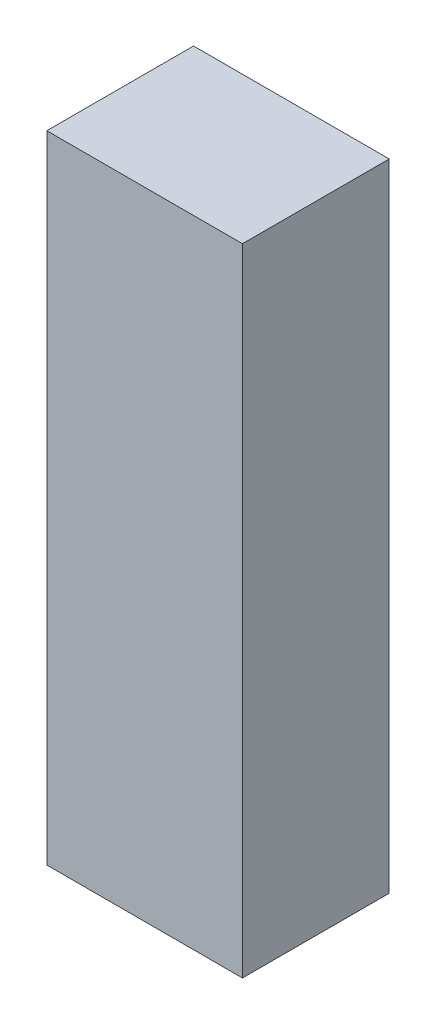
ISO-10303-21;
HEADER;
FILE_DESCRIPTION(('STEP AP214'),'2;1');
FILE_NAME('part.step','',(''),(''),'','','');
FILE_SCHEMA(('AUTOMOTIVE_DESIGN { 1 0 10303 214 1 1 1 1 }'));
ENDSEC;
DATA;
#1=APPLICATION_CONTEXT('core data for automotive mechanical design processes');
#2=APPLICATION_PROTOCOL_DEFINITION('international standard','automotive_design',2000,#1);
#3=PRODUCT_CONTEXT('',#1,'mechanical');
#4=PRODUCT('Part','Part','',(#3));
#5=PRODUCT_RELATED_PRODUCT_CATEGORY('part','',(#4));
#6=PRODUCT_DEFINITION_FORMATION('','',#4);
#7=PRODUCT_DEFINITION_CONTEXT('part definition',#1,'design');
#8=PRODUCT_DEFINITION('design','',#6,#7);
#9=PRODUCT_DEFINITION_SHAPE('','',#8);
#10=(LENGTH_UNIT() NAMED_UNIT(*) SI_UNIT(.MILLI.,.METRE.));
#11=(NAMED_UNIT(*) PLANE_ANGLE_UNIT() SI_UNIT($,.RADIAN.));
#12=(NAMED_UNIT(*) SI_UNIT($,.STERADIAN.) SOLID_ANGLE_UNIT());
#13=UNCERTAINTY_MEASURE_WITH_UNIT(LENGTH_MEASURE(1.E-05),#10,'distance_accuracy_value','');
#14=(GEOMETRIC_REPRESENTATION_CONTEXT(3) GLOBAL_UNCERTAINTY_ASSIGNED_CONTEXT((#13)) GLOBAL_UNIT_ASSIGNED_CONTEXT((#10,
#11,#12)) REPRESENTATION_CONTEXT('',''));
#15=CARTESIAN_POINT('',(0.,0.,0.));
#16=DIRECTION('',(0.,0.,1.));
#17=DIRECTION('',(1.,0.,0.));
#18=AXIS2_PLACEMENT_3D('',#15,#16,#17);
#19=CARTESIAN_POINT('',(-0.1999996,0.65000124,0.3));
#20=DIRECTION('',(0.,0.,1.));
#21=DIRECTION('',(1.,0.,0.));
#22=AXIS2_PLACEMENT_3D('',#19,#20,#21);
#23=PLANE('',#22);
#24=DIRECTION('',(0.,1.,0.));
#25=VECTOR('',#24,1.);
#26=CARTESIAN_POINT('',(0.20000214,0.65000124,0.3));
#27=LINE('',#26,#25);
#28=CARTESIAN_POINT('',(0.20000214,0.65000124,0.3));
#29=VERTEX_POINT('',#28);
#30=CARTESIAN_POINT('',(0.20000214,-0.6499987,0.3));
#31=VERTEX_POINT('',#30);
#32=EDGE_CURVE('E53',#29,#31,#27,.F.);
#33=ORIENTED_EDGE('',*,*,#32,.F.);
#34=DIRECTION('',(1.,0.,0.));
#35=VECTOR('',#34,1.);
#36=CARTESIAN_POINT('',(-0.1999996,0.65000124,0.3));
#37=LINE('',#36,#35);
#38=CARTESIAN_POINT('',(-0.1999996,0.65000124,0.3));
#39=VERTEX_POINT('',#38);
#40=EDGE_CURVE('E69',#39,#29,#37,.T.);
#41=ORIENTED_EDGE('',*,*,#40,.F.);
#42=DIRECTION('',(0.,1.,0.));
#43=VECTOR('',#42,1.);
#44=CARTESIAN_POINT('',(-0.1999996,-0.6499987,0.3));
#45=LINE('',#44,#43);
#46=CARTESIAN_POINT('',(-0.1999996,-0.6499987,0.3));
#47=VERTEX_POINT('',#46);
#48=EDGE_CURVE('E19',#47,#39,#45,.T.);
#49=ORIENTED_EDGE('',*,*,#48,.F.);
#50=DIRECTION('',(1.,0.,0.));
#51=VECTOR('',#50,1.);
#52=CARTESIAN_POINT('',(0.20000214,-0.6499987,0.3));
#53=LINE('',#52,#51);
#54=EDGE_CURVE('E58',#31,#47,#53,.F.);
#55=ORIENTED_EDGE('',*,*,#54,.F.);
#56=EDGE_LOOP('',(#33,#41,#49,#55));
#57=FACE_BOUND('',#56,.T.);
#58=ADVANCED_FACE('F16',(#57),#23,.T.);
#59=CARTESIAN_POINT('',(-0.1999996,-0.6499987,0.));
#60=DIRECTION('',(-1.,0.,0.));
#61=DIRECTION('',(0.,0.,1.));
#62=AXIS2_PLACEMENT_3D('',#59,#60,#61);
#63=PLANE('',#62);
#64=DIRECTION('',(0.,0.,1.));
#65=VECTOR('',#64,1.);
#66=CARTESIAN_POINT('',(-0.1999996,0.65000124,0.));
#67=LINE('',#66,#65);
#68=CARTESIAN_POINT('',(-0.1999996,0.65000124,0.));
#69=VERTEX_POINT('',#68);
#70=EDGE_CURVE('E88',#69,#39,#67,.T.);
#71=ORIENTED_EDGE('',*,*,#70,.F.);
#72=DIRECTION('',(0.,1.,0.));
#73=VECTOR('',#72,1.);
#74=CARTESIAN_POINT('',(-0.1999996,0.65000124,0.));
#75=LINE('',#74,#73);
#76=CARTESIAN_POINT('',(-0.1999996,-0.6499987,0.));
#77=VERTEX_POINT('',#76);
#78=EDGE_CURVE('E76',#69,#77,#75,.F.);
#79=ORIENTED_EDGE('',*,*,#78,.T.);
#80=DIRECTION('',(0.,0.,-1.));
#81=VECTOR('',#80,1.);
#82=CARTESIAN_POINT('',(-0.1999996,-0.6499987,0.));
#83=LINE('',#82,#81);
#84=EDGE_CURVE('E63',#47,#77,#83,.T.);
#85=ORIENTED_EDGE('',*,*,#84,.F.);
#86=ORIENTED_EDGE('',*,*,#48,.T.);
#87=EDGE_LOOP('',(#71,#79,#85,#86));
#88=FACE_BOUND('',#87,.T.);
#89=ADVANCED_FACE('F75',(#88),#63,.T.);
#90=CARTESIAN_POINT('',(0.20000214,-0.6499987,0.));
#91=DIRECTION('',(0.,-1.,0.));
#92=DIRECTION('',(0.,0.,-1.));
#93=AXIS2_PLACEMENT_3D('',#90,#91,#92);
#94=PLANE('',#93);
#95=ORIENTED_EDGE('',*,*,#84,.T.);
#96=DIRECTION('',(1.,0.,0.));
#97=VECTOR('',#96,1.);
#98=CARTESIAN_POINT('',(-0.1999996,-0.6499987,0.));
#99=LINE('',#98,#97);
#100=CARTESIAN_POINT('',(0.20000214,-0.6499987,0.));
#101=VERTEX_POINT('',#100);
#102=EDGE_CURVE('E96',#77,#101,#99,.T.);
#103=ORIENTED_EDGE('',*,*,#102,.T.);
#104=DIRECTION('',(0.,0.,-1.));
#105=VECTOR('',#104,1.);
#106=CARTESIAN_POINT('',(0.20000214,-0.6499987,0.));
#107=LINE('',#106,#105);
#108=EDGE_CURVE('E65',#31,#101,#107,.T.);
#109=ORIENTED_EDGE('',*,*,#108,.F.);
#110=ORIENTED_EDGE('',*,*,#54,.T.);
#111=EDGE_LOOP('',(#95,#103,#109,#110));
#112=FACE_BOUND('',#111,.T.);
#113=ADVANCED_FACE('F60',(#112),#94,.T.);
#114=CARTESIAN_POINT('',(0.20000214,0.65000124,0.));
#115=DIRECTION('',(1.,0.,0.));
#116=DIRECTION('',(0.,0.,-1.));
#117=AXIS2_PLACEMENT_3D('',#114,#115,#116);
#118=PLANE('',#117);
#119=ORIENTED_EDGE('',*,*,#108,.T.);
#120=DIRECTION('',(0.,1.,0.));
#121=VECTOR('',#120,1.);
#122=CARTESIAN_POINT('',(0.20000214,0.65000124,0.));
#123=LINE('',#122,#121);
#124=CARTESIAN_POINT('',(0.20000214,0.65000124,0.));
#125=VERTEX_POINT('',#124);
#126=EDGE_CURVE('E26',#101,#125,#123,.T.);
#127=ORIENTED_EDGE('',*,*,#126,.T.);
#128=DIRECTION('',(0.,0.,1.));
#129=VECTOR('',#128,1.);
#130=CARTESIAN_POINT('',(0.20000214,0.65000124,0.));
#131=LINE('',#130,#129);
#132=EDGE_CURVE('E34',#29,#125,#131,.F.);
#133=ORIENTED_EDGE('',*,*,#132,.F.);
#134=ORIENTED_EDGE('',*,*,#32,.T.);
#135=EDGE_LOOP('',(#119,#127,#133,#134));
#136=FACE_BOUND('',#135,.T.);
#137=ADVANCED_FACE('F102',(#136),#118,.T.);
#138=CARTESIAN_POINT('',(-0.1999996,0.65000124,0.));
#139=DIRECTION('',(0.,1.,0.));
#140=DIRECTION('',(0.,0.,1.));
#141=AXIS2_PLACEMENT_3D('',#138,#139,#140);
#142=PLANE('',#141);
#143=ORIENTED_EDGE('',*,*,#132,.T.);
#144=DIRECTION('',(1.,0.,0.));
#145=VECTOR('',#144,1.);
#146=CARTESIAN_POINT('',(-0.1999996,0.65000124,0.));
#147=LINE('',#146,#145);
#148=EDGE_CURVE('E11',#125,#69,#147,.F.);
#149=ORIENTED_EDGE('',*,*,#148,.T.);
#150=ORIENTED_EDGE('',*,*,#70,.T.);
#151=ORIENTED_EDGE('',*,*,#40,.T.);
#152=EDGE_LOOP('',(#143,#149,#150,#151));
#153=FACE_BOUND('',#152,.T.);
#154=ADVANCED_FACE('F105',(#153),#142,.T.);
#155=CARTESIAN_POINT('',(-0.1999996,0.65000124,0.));
#156=DIRECTION('',(0.,0.,1.));
#157=DIRECTION('',(1.,0.,0.));
#158=AXIS2_PLACEMENT_3D('',#155,#156,#157);
#159=PLANE('',#158);
#160=ORIENTED_EDGE('',*,*,#126,.F.);
#161=ORIENTED_EDGE('',*,*,#102,.F.);
#162=ORIENTED_EDGE('',*,*,#78,.F.);
#163=ORIENTED_EDGE('',*,*,#148,.F.);
#164=EDGE_LOOP('',(#160,#161,#162,#163));
#165=FACE_BOUND('',#164,.T.);
#166=ADVANCED_FACE('F104',(#165),#159,.F.);
#167=CLOSED_SHELL('',(#58,#89,#113,#137,#154,#166));
#168=MANIFOLD_SOLID_BREP('B1',#167);
#169=ADVANCED_BREP_SHAPE_REPRESENTATION('',(#18,#168),#14);
#170=SHAPE_DEFINITION_REPRESENTATION(#9,#169);
ENDSEC;
END-ISO-10303-21;
